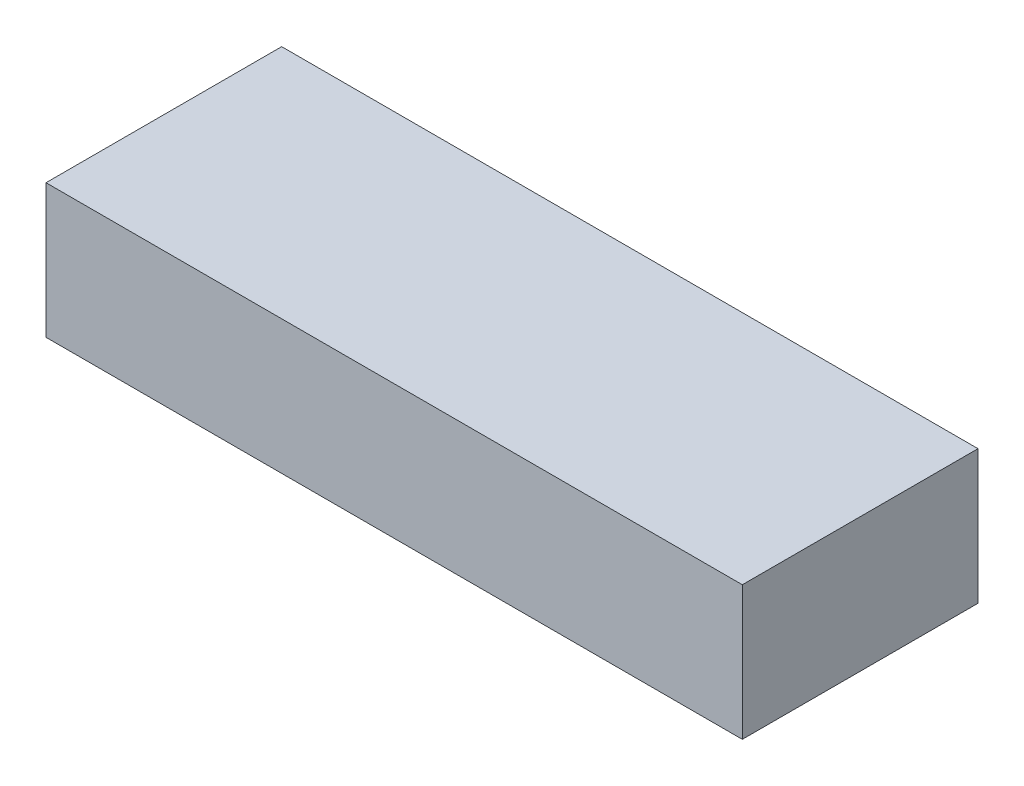
ISO-10303-21;
HEADER;
FILE_DESCRIPTION(('STEP AP214'),'2;1');
FILE_NAME('part.step','',(''),(''),'','','');
FILE_SCHEMA(('AUTOMOTIVE_DESIGN { 1 0 10303 214 1 1 1 1 }'));
ENDSEC;
DATA;
#1=APPLICATION_CONTEXT('core data for automotive mechanical design processes');
#2=APPLICATION_PROTOCOL_DEFINITION('international standard','automotive_design',2000,#1);
#3=PRODUCT_CONTEXT('',#1,'mechanical');
#4=PRODUCT('Part','Part','',(#3));
#5=PRODUCT_RELATED_PRODUCT_CATEGORY('part','',(#4));
#6=PRODUCT_DEFINITION_FORMATION('','',#4);
#7=PRODUCT_DEFINITION_CONTEXT('part definition',#1,'design');
#8=PRODUCT_DEFINITION('design','',#6,#7);
#9=PRODUCT_DEFINITION_SHAPE('','',#8);
#10=(LENGTH_UNIT() NAMED_UNIT(*) SI_UNIT(.MILLI.,.METRE.));
#11=(NAMED_UNIT(*) PLANE_ANGLE_UNIT() SI_UNIT($,.RADIAN.));
#12=(NAMED_UNIT(*) SI_UNIT($,.STERADIAN.) SOLID_ANGLE_UNIT());
#13=UNCERTAINTY_MEASURE_WITH_UNIT(LENGTH_MEASURE(1.E-05),#10,'distance_accuracy_value','');
#14=(GEOMETRIC_REPRESENTATION_CONTEXT(3) GLOBAL_UNCERTAINTY_ASSIGNED_CONTEXT((#13)) GLOBAL_UNIT_ASSIGNED_CONTEXT((#10,
#11,#12)) REPRESENTATION_CONTEXT('',''));
#15=CARTESIAN_POINT('',(0.,0.,0.));
#16=DIRECTION('',(0.,0.,1.));
#17=DIRECTION('',(1.,0.,0.));
#18=AXIS2_PLACEMENT_3D('',#15,#16,#17);
#19=CARTESIAN_POINT('',(-38.9894736842106,25.,22.1157894736842));
#20=DIRECTION('',(1.,0.,0.));
#21=DIRECTION('',(0.,0.,-1.));
#22=AXIS2_PLACEMENT_3D('',#19,#20,#21);
#23=PLANE('',#22);
#24=DIRECTION('',(0.,0.,1.));
#25=VECTOR('',#24,1.);
#26=CARTESIAN_POINT('',(-38.9894736842106,0.,22.1157894736842));
#27=LINE('',#26,#25);
#28=CARTESIAN_POINT('',(-38.9894736842106,0.,-21.8842105263158));
#29=VERTEX_POINT('',#28);
#30=CARTESIAN_POINT('',(-38.9894736842106,0.,22.1157894736842));
#31=VERTEX_POINT('',#30);
#32=EDGE_CURVE('E96',#29,#31,#27,.T.);
#33=ORIENTED_EDGE('',*,*,#32,.T.);
#34=DIRECTION('',(0.,-1.,0.));
#35=VECTOR('',#34,1.);
#36=CARTESIAN_POINT('',(-38.9894736842106,25.,22.1157894736842));
#37=LINE('',#36,#35);
#38=CARTESIAN_POINT('',(-38.9894736842106,25.,22.1157894736842));
#39=VERTEX_POINT('',#38);
#40=EDGE_CURVE('E11',#39,#31,#37,.T.);
#41=ORIENTED_EDGE('',*,*,#40,.F.);
#42=DIRECTION('',(0.,0.,1.));
#43=VECTOR('',#42,1.);
#44=CARTESIAN_POINT('',(-38.9894736842106,25.,22.1157894736842));
#45=LINE('',#44,#43);
#46=CARTESIAN_POINT('',(-38.9894736842106,25.,-21.8842105263158));
#47=VERTEX_POINT('',#46);
#48=EDGE_CURVE('E84',#47,#39,#45,.T.);
#49=ORIENTED_EDGE('',*,*,#48,.F.);
#50=DIRECTION('',(0.,-1.,0.));
#51=VECTOR('',#50,1.);
#52=CARTESIAN_POINT('',(-38.9894736842106,25.,-21.8842105263158));
#53=LINE('',#52,#51);
#54=EDGE_CURVE('E92',#47,#29,#53,.T.);
#55=ORIENTED_EDGE('',*,*,#54,.T.);
#56=EDGE_LOOP('',(#33,#41,#49,#55));
#57=FACE_BOUND('',#56,.T.);
#58=ADVANCED_FACE('F33',(#57),#23,.F.);
#59=CARTESIAN_POINT('',(-38.9894736842106,25.,22.1157894736842));
#60=DIRECTION('',(0.,0.,-1.));
#61=DIRECTION('',(-1.,0.,0.));
#62=AXIS2_PLACEMENT_3D('',#59,#60,#61);
#63=PLANE('',#62);
#64=DIRECTION('',(1.,0.,0.));
#65=VECTOR('',#64,1.);
#66=CARTESIAN_POINT('',(-38.9894736842106,0.,22.1157894736842));
#67=LINE('',#66,#65);
#68=CARTESIAN_POINT('',(91.0105263157894,0.,22.1157894736842));
#69=VERTEX_POINT('',#68);
#70=EDGE_CURVE('E88',#31,#69,#67,.T.);
#71=ORIENTED_EDGE('',*,*,#70,.T.);
#72=DIRECTION('',(0.,-1.,0.));
#73=VECTOR('',#72,1.);
#74=CARTESIAN_POINT('',(91.0105263157894,25.,22.1157894736842));
#75=LINE('',#74,#73);
#76=CARTESIAN_POINT('',(91.0105263157894,25.,22.1157894736842));
#77=VERTEX_POINT('',#76);
#78=EDGE_CURVE('E41',#77,#69,#75,.T.);
#79=ORIENTED_EDGE('',*,*,#78,.F.);
#80=DIRECTION('',(1.,0.,0.));
#81=VECTOR('',#80,1.);
#82=CARTESIAN_POINT('',(-38.9894736842106,25.,22.1157894736842));
#83=LINE('',#82,#81);
#84=EDGE_CURVE('E79',#39,#77,#83,.T.);
#85=ORIENTED_EDGE('',*,*,#84,.F.);
#86=ORIENTED_EDGE('',*,*,#40,.T.);
#87=EDGE_LOOP('',(#71,#79,#85,#86));
#88=FACE_BOUND('',#87,.T.);
#89=ADVANCED_FACE('F87',(#88),#63,.F.);
#90=CARTESIAN_POINT('',(91.0105263157894,25.,22.1157894736842));
#91=DIRECTION('',(-1.,0.,0.));
#92=DIRECTION('',(0.,0.,1.));
#93=AXIS2_PLACEMENT_3D('',#90,#91,#92);
#94=PLANE('',#93);
#95=DIRECTION('',(0.,0.,-1.));
#96=VECTOR('',#95,1.);
#97=CARTESIAN_POINT('',(91.0105263157894,0.,22.1157894736842));
#98=LINE('',#97,#96);
#99=CARTESIAN_POINT('',(91.0105263157894,0.,-21.8842105263158));
#100=VERTEX_POINT('',#99);
#101=EDGE_CURVE('E66',#69,#100,#98,.T.);
#102=ORIENTED_EDGE('',*,*,#101,.T.);
#103=DIRECTION('',(0.,-1.,0.));
#104=VECTOR('',#103,1.);
#105=CARTESIAN_POINT('',(91.0105263157894,25.,-21.8842105263158));
#106=LINE('',#105,#104);
#107=CARTESIAN_POINT('',(91.0105263157894,25.,-21.8842105263158));
#108=VERTEX_POINT('',#107);
#109=EDGE_CURVE('E89',#108,#100,#106,.T.);
#110=ORIENTED_EDGE('',*,*,#109,.F.);
#111=DIRECTION('',(0.,0.,-1.));
#112=VECTOR('',#111,1.);
#113=CARTESIAN_POINT('',(91.0105263157894,25.,22.1157894736842));
#114=LINE('',#113,#112);
#115=EDGE_CURVE('E82',#77,#108,#114,.T.);
#116=ORIENTED_EDGE('',*,*,#115,.F.);
#117=ORIENTED_EDGE('',*,*,#78,.T.);
#118=EDGE_LOOP('',(#102,#110,#116,#117));
#119=FACE_BOUND('',#118,.T.);
#120=ADVANCED_FACE('F90',(#119),#94,.F.);
#121=CARTESIAN_POINT('',(-38.9894736842106,25.,-21.8842105263158));
#122=DIRECTION('',(0.,0.,1.));
#123=DIRECTION('',(1.,0.,0.));
#124=AXIS2_PLACEMENT_3D('',#121,#122,#123);
#125=PLANE('',#124);
#126=DIRECTION('',(-1.,0.,0.));
#127=VECTOR('',#126,1.);
#128=CARTESIAN_POINT('',(-38.9894736842106,0.,-21.8842105263158));
#129=LINE('',#128,#127);
#130=EDGE_CURVE('E72',#100,#29,#129,.T.);
#131=ORIENTED_EDGE('',*,*,#130,.T.);
#132=ORIENTED_EDGE('',*,*,#54,.F.);
#133=DIRECTION('',(-1.,0.,0.));
#134=VECTOR('',#133,1.);
#135=CARTESIAN_POINT('',(-38.9894736842106,25.,-21.8842105263158));
#136=LINE('',#135,#134);
#137=EDGE_CURVE('E49',#108,#47,#136,.T.);
#138=ORIENTED_EDGE('',*,*,#137,.F.);
#139=ORIENTED_EDGE('',*,*,#109,.T.);
#140=EDGE_LOOP('',(#131,#132,#138,#139));
#141=FACE_BOUND('',#140,.T.);
#142=ADVANCED_FACE('F103',(#141),#125,.F.);
#143=CARTESIAN_POINT('',(0.,25.,0.));
#144=DIRECTION('',(0.,-1.,0.));
#145=DIRECTION('',(0.,0.,-1.));
#146=AXIS2_PLACEMENT_3D('',#143,#144,#145);
#147=PLANE('',#146);
#148=ORIENTED_EDGE('',*,*,#48,.T.);
#149=ORIENTED_EDGE('',*,*,#84,.T.);
#150=ORIENTED_EDGE('',*,*,#115,.T.);
#151=ORIENTED_EDGE('',*,*,#137,.T.);
#152=EDGE_LOOP('',(#148,#149,#150,#151));
#153=FACE_BOUND('',#152,.T.);
#154=ADVANCED_FACE('F80',(#153),#147,.F.);
#155=CARTESIAN_POINT('',(0.,0.,0.));
#156=DIRECTION('',(0.,-1.,0.));
#157=DIRECTION('',(0.,0.,-1.));
#158=AXIS2_PLACEMENT_3D('',#155,#156,#157);
#159=PLANE('',#158);
#160=ORIENTED_EDGE('',*,*,#32,.F.);
#161=ORIENTED_EDGE('',*,*,#130,.F.);
#162=ORIENTED_EDGE('',*,*,#101,.F.);
#163=ORIENTED_EDGE('',*,*,#70,.F.);
#164=EDGE_LOOP('',(#160,#161,#162,#163));
#165=FACE_BOUND('',#164,.T.);
#166=ADVANCED_FACE('F106',(#165),#159,.T.);
#167=CLOSED_SHELL('',(#58,#89,#120,#142,#154,#166));
#168=MANIFOLD_SOLID_BREP('B2',#167);
#169=ADVANCED_BREP_SHAPE_REPRESENTATION('',(#18,#168),#14);
#170=SHAPE_DEFINITION_REPRESENTATION(#9,#169);
ENDSEC;
END-ISO-10303-21;
